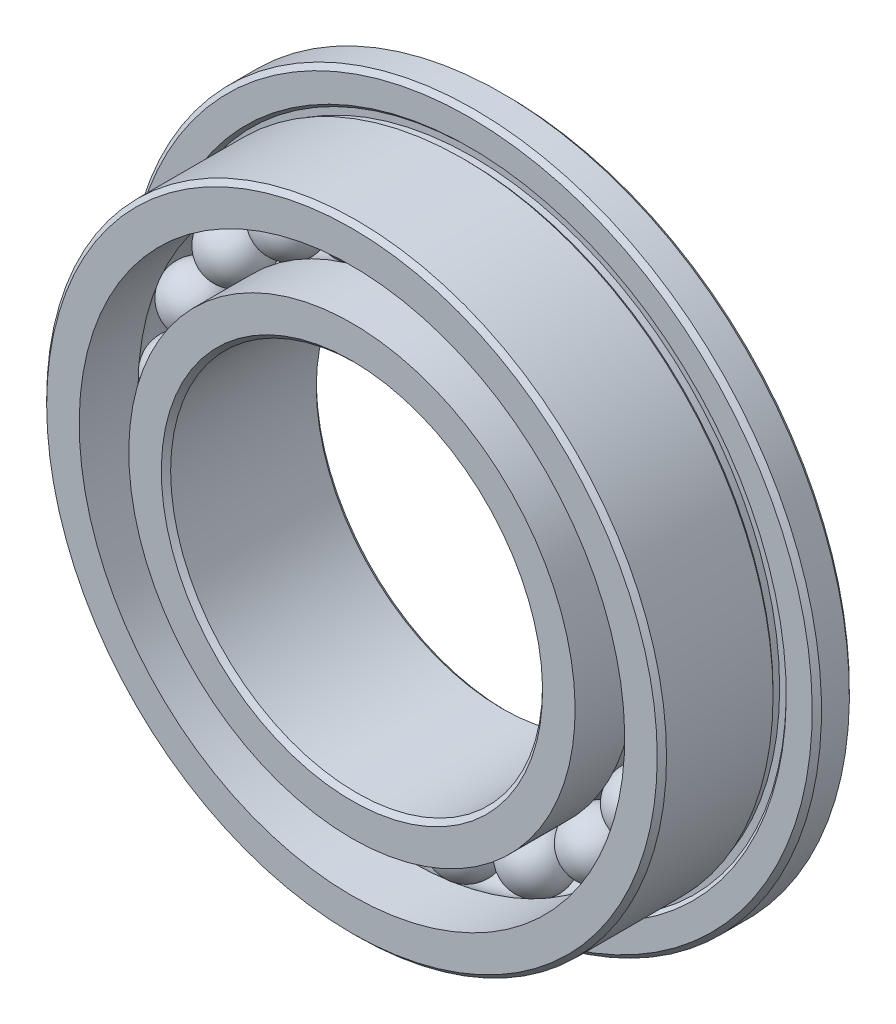
ISO-10303-21;
HEADER;
FILE_DESCRIPTION(('STEP AP214'),'2;1');
FILE_NAME('part.step','',(''),(''),'','','');
FILE_SCHEMA(('AUTOMOTIVE_DESIGN { 1 0 10303 214 1 1 1 1 }'));
ENDSEC;
DATA;
#1=APPLICATION_CONTEXT('core data for automotive mechanical design processes');
#2=APPLICATION_PROTOCOL_DEFINITION('international standard','automotive_design',2000,#1);
#3=PRODUCT_CONTEXT('',#1,'mechanical');
#4=PRODUCT('Part','Part','',(#3));
#5=PRODUCT_RELATED_PRODUCT_CATEGORY('part','',(#4));
#6=PRODUCT_DEFINITION_FORMATION('','',#4);
#7=PRODUCT_DEFINITION_CONTEXT('part definition',#1,'design');
#8=PRODUCT_DEFINITION('design','',#6,#7);
#9=PRODUCT_DEFINITION_SHAPE('','',#8);
#10=(LENGTH_UNIT() NAMED_UNIT(*) SI_UNIT(.MILLI.,.METRE.));
#11=(NAMED_UNIT(*) PLANE_ANGLE_UNIT() SI_UNIT($,.RADIAN.));
#12=(NAMED_UNIT(*) SI_UNIT($,.STERADIAN.) SOLID_ANGLE_UNIT());
#13=UNCERTAINTY_MEASURE_WITH_UNIT(LENGTH_MEASURE(1.E-05),#10,'distance_accuracy_value','');
#14=(GEOMETRIC_REPRESENTATION_CONTEXT(3) GLOBAL_UNCERTAINTY_ASSIGNED_CONTEXT((#13)) GLOBAL_UNIT_ASSIGNED_CONTEXT((#10,
#11,#12)) REPRESENTATION_CONTEXT('',''));
#15=CARTESIAN_POINT('',(0.,0.,0.));
#16=DIRECTION('',(0.,0.,1.));
#17=DIRECTION('',(1.,0.,0.));
#18=AXIS2_PLACEMENT_3D('',#15,#16,#17);
#19=CARTESIAN_POINT('',(-1.17902069764356,3.82229122314458,0.));
#20=DIRECTION('',(-0.294755174410891,0.955572805786145,0.));
#21=DIRECTION('',(0.955572805786145,0.294755174410891,0.));
#22=AXIS2_PLACEMENT_3D('',#19,#20,#21);
#23=SPHERICAL_SURFACE('',#22,0.5);
#24=CARTESIAN_POINT('',(-1.32639828484901,4.30007762603765,0.));
#25=VERTEX_POINT('',#24);
#26=VERTEX_LOOP('',#25);
#27=FACE_BOUND('',#26,.T.);
#28=ADVANCED_FACE('F50',(#27),#23,.T.);
#29=CLOSED_SHELL('',(#28));
#30=MANIFOLD_SOLID_BREP('B2',#29);
#31=CARTESIAN_POINT('',(-2.25328023225445,3.30495509726401,0.));
#32=DIRECTION('',(-0.563320058063612,0.826238774316002,0.));
#33=DIRECTION('',(0.826238774316002,0.563320058063612,0.));
#34=AXIS2_PLACEMENT_3D('',#31,#32,#33);
#35=SPHERICAL_SURFACE('',#34,0.5);
#36=CARTESIAN_POINT('',(-2.53494026128625,3.71807448442201,0.));
#37=VERTEX_POINT('',#36);
#38=VERTEX_LOOP('',#37);
#39=FACE_BOUND('',#38,.T.);
#40=ADVANCED_FACE('F71',(#39),#35,.T.);
#41=CLOSED_SHELL('',(#40));
#42=MANIFOLD_SOLID_BREP('B7',#41);
#43=CARTESIAN_POINT('',(-3.12732592987209,2.49395920743497,0.));
#44=DIRECTION('',(-0.781831482468022,0.623489801858743,0.));
#45=DIRECTION('',(0.623489801858743,0.781831482468022,0.));
#46=AXIS2_PLACEMENT_3D('',#43,#44,#45);
#47=SPHERICAL_SURFACE('',#46,0.5);
#48=CARTESIAN_POINT('',(-3.5182416711061,2.80570410836434,0.));
#49=VERTEX_POINT('',#48);
#50=VERTEX_LOOP('',#49);
#51=FACE_BOUND('',#50,.T.);
#52=ADVANCED_FACE('F92',(#51),#47,.T.);
#53=CLOSED_SHELL('',(#52));
#54=MANIFOLD_SOLID_BREP('B46',#53);
#55=CARTESIAN_POINT('',(-3.7234949945768,1.46136409746562,0.));
#56=DIRECTION('',(-0.9308737486442,0.365341024366405,0.));
#57=DIRECTION('',(0.365341024366405,0.9308737486442,0.));
#58=AXIS2_PLACEMENT_3D('',#55,#56,#57);
#59=SPHERICAL_SURFACE('',#58,0.5);
#60=CARTESIAN_POINT('',(-4.1889318688989,1.64403460964882,0.));
#61=VERTEX_POINT('',#60);
#62=VERTEX_LOOP('',#61);
#63=FACE_BOUND('',#62,.T.);
#64=ADVANCED_FACE('F113',(#63),#59,.T.);
#65=CLOSED_SHELL('',(#64));
#66=MANIFOLD_SOLID_BREP('B67',#65);
#67=CARTESIAN_POINT('',(-3.98881518872472,0.29892037434574,0.));
#68=DIRECTION('',(-0.997203797181179,0.0747300935864348,0.));
#69=DIRECTION('',(0.0747300935864348,0.997203797181179,0.));
#70=AXIS2_PLACEMENT_3D('',#67,#68,#69);
#71=SPHERICAL_SURFACE('',#70,0.5);
#72=CARTESIAN_POINT('',(-4.48741708731531,0.336285421138957,0.));
#73=VERTEX_POINT('',#72);
#74=VERTEX_LOOP('',#73);
#75=FACE_BOUND('',#74,.T.);
#76=ADVANCED_FACE('F134',(#75),#71,.T.);
#77=CLOSED_SHELL('',(#76));
#78=MANIFOLD_SOLID_BREP('B88',#77);
#79=CARTESIAN_POINT('',(-3.8997116487273,-0.890083735825217,0.));
#80=DIRECTION('',(-0.974927912181826,-0.222520933956304,0.));
#81=DIRECTION('',(-0.222520933956304,0.974927912181826,0.));
#82=AXIS2_PLACEMENT_3D('',#79,#80,#81);
#83=SPHERICAL_SURFACE('',#82,0.5);
#84=CARTESIAN_POINT('',(-4.38717560481822,-1.00134420280337,0.));
#85=VERTEX_POINT('',#84);
#86=VERTEX_LOOP('',#85);
#87=FACE_BOUND('',#86,.T.);
#88=ADVANCED_FACE('F155',(#87),#83,.T.);
#89=CLOSED_SHELL('',(#88));
#90=MANIFOLD_SOLID_BREP('B109',#89);
#91=CARTESIAN_POINT('',(-3.46410161513777,-1.99999999999997,0.));
#92=DIRECTION('',(-0.866025403784443,-0.499999999999992,0.));
#93=DIRECTION('',(-0.499999999999992,0.866025403784443,0.));
#94=AXIS2_PLACEMENT_3D('',#91,#92,#93);
#95=SPHERICAL_SURFACE('',#94,0.5);
#96=CARTESIAN_POINT('',(-3.89711431702999,-2.24999999999996,0.));
#97=VERTEX_POINT('',#96);
#98=VERTEX_LOOP('',#97);
#99=FACE_BOUND('',#98,.T.);
#100=ADVANCED_FACE('F176',(#99),#95,.T.);
#101=CLOSED_SHELL('',(#100));
#102=MANIFOLD_SOLID_BREP('B130',#101);
#103=CARTESIAN_POINT('',(-2.7206909510837,-2.93220748731928,0.));
#104=DIRECTION('',(-0.680172737770926,-0.733051871829821,0.));
#105=DIRECTION('',(-0.733051871829821,0.680172737770926,0.));
#106=AXIS2_PLACEMENT_3D('',#103,#104,#105);
#107=SPHERICAL_SURFACE('',#106,0.5);
#108=CARTESIAN_POINT('',(-3.06077731996917,-3.29873342323419,0.));
#109=VERTEX_POINT('',#108);
#110=VERTEX_LOOP('',#109);
#111=FACE_BOUND('',#110,.T.);
#112=ADVANCED_FACE('F197',(#111),#107,.T.);
#113=CLOSED_SHELL('',(#112));
#114=MANIFOLD_SOLID_BREP('B151',#113);
#115=CARTESIAN_POINT('',(-1.73553495647026,-3.60387547160966,0.));
#116=DIRECTION('',(-0.433883739117565,-0.900968867902416,0.));
#117=DIRECTION('',(-0.900968867902416,0.433883739117565,0.));
#118=AXIS2_PLACEMENT_3D('',#115,#116,#117);
#119=SPHERICAL_SURFACE('',#118,0.5);
#120=CARTESIAN_POINT('',(-1.95247682602904,-4.05435990556087,0.));
#121=VERTEX_POINT('',#120);
#122=VERTEX_LOOP('',#121);
#123=FACE_BOUND('',#122,.T.);
#124=ADVANCED_FACE('F218',(#123),#119,.T.);
#125=CLOSED_SHELL('',(#124));
#126=MANIFOLD_SOLID_BREP('B172',#125);
#127=CARTESIAN_POINT('',(-0.596169064704728,-3.95532330490051,0.));
#128=DIRECTION('',(-0.149042266176182,-0.988830826225127,0.));
#129=DIRECTION('',(-0.988830826225127,0.149042266176182,0.));
#130=AXIS2_PLACEMENT_3D('',#127,#128,#129);
#131=SPHERICAL_SURFACE('',#130,0.5);
#132=CARTESIAN_POINT('',(-0.670690197792819,-4.44973871801307,0.));
#133=VERTEX_POINT('',#132);
#134=VERTEX_LOOP('',#133);
#135=FACE_BOUND('',#134,.T.);
#136=ADVANCED_FACE('F239',(#135),#131,.T.);
#137=CLOSED_SHELL('',(#136));
#138=MANIFOLD_SOLID_BREP('B193',#137);
#139=CARTESIAN_POINT('',(0.596169064704671,-3.95532330490052,0.));
#140=DIRECTION('',(0.149042266176168,-0.98883082622513,0.));
#141=DIRECTION('',(-0.98883082622513,-0.149042266176168,0.));
#142=AXIS2_PLACEMENT_3D('',#139,#140,#141);
#143=SPHERICAL_SURFACE('',#142,0.5);
#144=CARTESIAN_POINT('',(0.670690197792755,-4.44973871801308,0.));
#145=VERTEX_POINT('',#144);
#146=VERTEX_LOOP('',#145);
#147=FACE_BOUND('',#146,.T.);
#148=ADVANCED_FACE('F260',(#147),#143,.T.);
#149=CLOSED_SHELL('',(#148));
#150=MANIFOLD_SOLID_BREP('B214',#149);
#151=CARTESIAN_POINT('',(1.73553495647021,-3.60387547160969,0.));
#152=DIRECTION('',(0.433883739117553,-0.900968867902422,0.));
#153=DIRECTION('',(-0.900968867902422,-0.433883739117553,0.));
#154=AXIS2_PLACEMENT_3D('',#151,#152,#153);
#155=SPHERICAL_SURFACE('',#154,0.5);
#156=CARTESIAN_POINT('',(1.95247682602899,-4.0543599055609,0.));
#157=VERTEX_POINT('',#156);
#158=VERTEX_LOOP('',#157);
#159=FACE_BOUND('',#158,.T.);
#160=ADVANCED_FACE('F281',(#159),#155,.T.);
#161=CLOSED_SHELL('',(#160));
#162=MANIFOLD_SOLID_BREP('B235',#161);
#163=CARTESIAN_POINT('',(2.72069095108366,-2.93220748731932,0.));
#164=DIRECTION('',(0.680172737770916,-0.73305187182983,0.));
#165=DIRECTION('',(-0.73305187182983,-0.680172737770916,0.));
#166=AXIS2_PLACEMENT_3D('',#163,#164,#165);
#167=SPHERICAL_SURFACE('',#166,0.5);
#168=CARTESIAN_POINT('',(3.06077731996912,-3.29873342323423,0.));
#169=VERTEX_POINT('',#168);
#170=VERTEX_LOOP('',#169);
#171=FACE_BOUND('',#170,.T.);
#172=ADVANCED_FACE('F302',(#171),#167,.T.);
#173=CLOSED_SHELL('',(#172));
#174=MANIFOLD_SOLID_BREP('B256',#173);
#175=CARTESIAN_POINT('',(3.46410161513775,-2.00000000000002,0.));
#176=DIRECTION('',(0.866025403784437,-0.500000000000004,0.));
#177=DIRECTION('',(-0.500000000000004,-0.866025403784437,0.));
#178=AXIS2_PLACEMENT_3D('',#175,#176,#177);
#179=SPHERICAL_SURFACE('',#178,0.5);
#180=CARTESIAN_POINT('',(3.89711431702996,-2.25000000000002,0.));
#181=VERTEX_POINT('',#180);
#182=VERTEX_LOOP('',#181);
#183=FACE_BOUND('',#182,.T.);
#184=ADVANCED_FACE('F323',(#183),#179,.T.);
#185=CLOSED_SHELL('',(#184));
#186=MANIFOLD_SOLID_BREP('B277',#185);
#187=CARTESIAN_POINT('',(3.89971164872729,-0.890083735825273,0.));
#188=DIRECTION('',(0.974927912181823,-0.222520933956318,0.));
#189=DIRECTION('',(-0.222520933956318,-0.974927912181823,0.));
#190=AXIS2_PLACEMENT_3D('',#187,#188,#189);
#191=SPHERICAL_SURFACE('',#190,0.5);
#192=CARTESIAN_POINT('',(4.3871756048182,-1.00134420280343,0.));
#193=VERTEX_POINT('',#192);
#194=VERTEX_LOOP('',#193);
#195=FACE_BOUND('',#194,.T.);
#196=ADVANCED_FACE('F344',(#195),#191,.T.);
#197=CLOSED_SHELL('',(#196));
#198=MANIFOLD_SOLID_BREP('B298',#197);
#199=CARTESIAN_POINT('',(3.98881518872472,0.298920374345683,0.));
#200=DIRECTION('',(0.997203797181181,0.074730093586421,0.));
#201=DIRECTION('',(0.074730093586421,-0.997203797181181,0.));
#202=AXIS2_PLACEMENT_3D('',#199,#200,#201);
#203=SPHERICAL_SURFACE('',#202,0.5);
#204=CARTESIAN_POINT('',(4.48741708731531,0.336285421138894,0.));
#205=VERTEX_POINT('',#204);
#206=VERTEX_LOOP('',#205);
#207=FACE_BOUND('',#206,.T.);
#208=ADVANCED_FACE('F365',(#207),#203,.T.);
#209=CLOSED_SHELL('',(#208));
#210=MANIFOLD_SOLID_BREP('B319',#209);
#211=CARTESIAN_POINT('',(3.72349499457682,1.46136409746557,0.));
#212=DIRECTION('',(0.930873748644205,0.365341024366393,0.));
#213=DIRECTION('',(0.365341024366393,-0.930873748644205,0.));
#214=AXIS2_PLACEMENT_3D('',#211,#212,#213);
#215=SPHERICAL_SURFACE('',#214,0.5);
#216=CARTESIAN_POINT('',(4.18893186889892,1.64403460964877,0.));
#217=VERTEX_POINT('',#216);
#218=VERTEX_LOOP('',#217);
#219=FACE_BOUND('',#218,.T.);
#220=ADVANCED_FACE('F386',(#219),#215,.T.);
#221=CLOSED_SHELL('',(#220));
#222=MANIFOLD_SOLID_BREP('B340',#221);
#223=CARTESIAN_POINT('',(3.12732592987212,2.49395920743493,0.));
#224=DIRECTION('',(0.781831482468031,0.623489801858732,0.));
#225=DIRECTION('',(0.623489801858732,-0.781831482468031,0.));
#226=AXIS2_PLACEMENT_3D('',#223,#224,#225);
#227=SPHERICAL_SURFACE('',#226,0.5);
#228=CARTESIAN_POINT('',(3.51824167110614,2.80570410836429,0.));
#229=VERTEX_POINT('',#228);
#230=VERTEX_LOOP('',#229);
#231=FACE_BOUND('',#230,.T.);
#232=ADVANCED_FACE('F407',(#231),#227,.T.);
#233=CLOSED_SHELL('',(#232));
#234=MANIFOLD_SOLID_BREP('B361',#233);
#235=CARTESIAN_POINT('',(2.25328023225449,3.30495509726398,0.));
#236=DIRECTION('',(0.563320058063623,0.826238774315994,0.));
#237=DIRECTION('',(0.826238774315994,-0.563320058063623,0.));
#238=AXIS2_PLACEMENT_3D('',#235,#236,#237);
#239=SPHERICAL_SURFACE('',#238,0.5);
#240=CARTESIAN_POINT('',(2.5349402612863,3.71807448442197,0.));
#241=VERTEX_POINT('',#240);
#242=VERTEX_LOOP('',#241);
#243=FACE_BOUND('',#242,.T.);
#244=ADVANCED_FACE('F428',(#243),#239,.T.);
#245=CLOSED_SHELL('',(#244));
#246=MANIFOLD_SOLID_BREP('B382',#245);
#247=CARTESIAN_POINT('',(1.17902069764362,3.82229122314456,0.));
#248=DIRECTION('',(0.294755174410905,0.955572805786141,0.));
#249=DIRECTION('',(0.955572805786141,-0.294755174410905,0.));
#250=AXIS2_PLACEMENT_3D('',#247,#248,#249);
#251=SPHERICAL_SURFACE('',#250,0.5);
#252=CARTESIAN_POINT('',(1.32639828484907,4.30007762603763,0.));
#253=VERTEX_POINT('',#252);
#254=VERTEX_LOOP('',#253);
#255=FACE_BOUND('',#254,.T.);
#256=ADVANCED_FACE('F449',(#255),#251,.T.);
#257=CLOSED_SHELL('',(#256));
#258=MANIFOLD_SOLID_BREP('B403',#257);
#259=CARTESIAN_POINT('',(0.,4.,0.));
#260=DIRECTION('',(0.,1.,0.));
#261=DIRECTION('',(1.,0.,0.));
#262=AXIS2_PLACEMENT_3D('',#259,#260,#261);
#263=SPHERICAL_SURFACE('',#262,0.5);
#264=CARTESIAN_POINT('',(0.,4.5,0.));
#265=VERTEX_POINT('',#264);
#266=VERTEX_LOOP('',#265);
#267=FACE_BOUND('',#266,.T.);
#268=ADVANCED_FACE('F473',(#267),#263,.T.);
#269=CLOSED_SHELL('',(#268));
#270=MANIFOLD_SOLID_BREP('B424',#269);
#271=CARTESIAN_POINT('',(0.,0.,0.));
#272=DIRECTION('',(0.,0.,1.));
#273=DIRECTION('',(0.,-1.,0.));
#274=AXIS2_PLACEMENT_3D('',#271,#272,#273);
#275=CYLINDRICAL_SURFACE('',#274,3.6);
#276=CARTESIAN_POINT('',(0.,0.,-0.3));
#277=DIRECTION('',(0.,0.,1.));
#278=DIRECTION('',(0.,-1.,0.));
#279=AXIS2_PLACEMENT_3D('',#276,#277,#278);
#280=CIRCLE('',#279,3.6);
#281=CARTESIAN_POINT('',(0.,-3.6,-0.3));
#282=VERTEX_POINT('',#281);
#283=EDGE_CURVE('E521',#282,#282,#280,.T.);
#284=ORIENTED_EDGE('',*,*,#283,.F.);
#285=EDGE_LOOP('',(#284));
#286=FACE_BOUND('',#285,.T.);
#287=CARTESIAN_POINT('',(0.,0.,-1.25));
#288=DIRECTION('',(0.,0.,1.));
#289=DIRECTION('',(0.,-1.,0.));
#290=AXIS2_PLACEMENT_3D('',#287,#288,#289);
#291=CIRCLE('',#290,3.6);
#292=CARTESIAN_POINT('',(0.,-3.6,-1.25));
#293=VERTEX_POINT('',#292);
#294=EDGE_CURVE('E533',#293,#293,#291,.T.);
#295=ORIENTED_EDGE('',*,*,#294,.T.);
#296=EDGE_LOOP('',(#295));
#297=FACE_BOUND('',#296,.T.);
#298=ADVANCED_FACE('F495',(#286,#297),#275,.T.);
#299=CARTESIAN_POINT('',(0.,0.,0.));
#300=DIRECTION('',(0.,0.,1.));
#301=DIRECTION('',(0.,-1.,0.));
#302=AXIS2_PLACEMENT_3D('',#299,#300,#301);
#303=TOROIDAL_SURFACE('',#302,4.,0.5);
#304=CARTESIAN_POINT('',(0.,0.,0.3));
#305=DIRECTION('',(0.,0.,1.));
#306=DIRECTION('',(0.,-1.,0.));
#307=AXIS2_PLACEMENT_3D('',#304,#305,#306);
#308=CIRCLE('',#307,3.6);
#309=CARTESIAN_POINT('',(0.,-3.6,0.3));
#310=VERTEX_POINT('',#309);
#311=EDGE_CURVE('E525',#310,#310,#308,.T.);
#312=ORIENTED_EDGE('',*,*,#311,.F.);
#313=EDGE_LOOP('',(#312));
#314=FACE_BOUND('',#313,.T.);
#315=ORIENTED_EDGE('',*,*,#283,.T.);
#316=EDGE_LOOP('',(#315));
#317=FACE_BOUND('',#316,.T.);
#318=ADVANCED_FACE('F554',(#314,#317),#303,.F.);
#319=CARTESIAN_POINT('',(0.,0.,0.));
#320=DIRECTION('',(0.,0.,1.));
#321=DIRECTION('',(0.,-1.,0.));
#322=AXIS2_PLACEMENT_3D('',#319,#320,#321);
#323=CYLINDRICAL_SURFACE('',#322,3.6);
#324=CARTESIAN_POINT('',(0.,0.,1.25));
#325=DIRECTION('',(0.,0.,1.));
#326=DIRECTION('',(0.,-1.,0.));
#327=AXIS2_PLACEMENT_3D('',#324,#325,#326);
#328=CIRCLE('',#327,3.6);
#329=CARTESIAN_POINT('',(0.,-3.6,1.25));
#330=VERTEX_POINT('',#329);
#331=EDGE_CURVE('E529',#330,#330,#328,.T.);
#332=ORIENTED_EDGE('',*,*,#331,.F.);
#333=EDGE_LOOP('',(#332));
#334=FACE_BOUND('',#333,.T.);
#335=ORIENTED_EDGE('',*,*,#311,.T.);
#336=EDGE_LOOP('',(#335));
#337=FACE_BOUND('',#336,.T.);
#338=ADVANCED_FACE('F560',(#334,#337),#323,.T.);
#339=CARTESIAN_POINT('',(0.,3.,1.25));
#340=DIRECTION('',(0.,0.,-1.));
#341=DIRECTION('',(0.,1.,0.));
#342=AXIS2_PLACEMENT_3D('',#339,#340,#341);
#343=PLANE('',#342);
#344=CARTESIAN_POINT('',(0.,0.,1.25));
#345=DIRECTION('',(0.,0.,-1.));
#346=DIRECTION('',(0.,1.,0.));
#347=AXIS2_PLACEMENT_3D('',#344,#345,#346);
#348=CIRCLE('',#347,3.075);
#349=CARTESIAN_POINT('',(0.,3.075,1.25));
#350=VERTEX_POINT('',#349);
#351=EDGE_CURVE('E472',#350,#350,#348,.T.);
#352=ORIENTED_EDGE('',*,*,#351,.T.);
#353=EDGE_LOOP('',(#352));
#354=FACE_BOUND('',#353,.T.);
#355=ORIENTED_EDGE('',*,*,#331,.T.);
#356=EDGE_LOOP('',(#355));
#357=FACE_BOUND('',#356,.T.);
#358=ADVANCED_FACE('F551',(#354,#357),#343,.F.);
#359=CARTESIAN_POINT('',(0.,0.,0.));
#360=DIRECTION('',(0.,0.,1.));
#361=DIRECTION('',(0.,-1.,0.));
#362=AXIS2_PLACEMENT_3D('',#359,#360,#361);
#363=CYLINDRICAL_SURFACE('',#362,3.);
#364=CARTESIAN_POINT('',(0.,0.,-1.175));
#365=DIRECTION('',(0.,0.,1.));
#366=DIRECTION('',(0.,-1.,0.));
#367=AXIS2_PLACEMENT_3D('',#364,#365,#366);
#368=CIRCLE('',#367,3.);
#369=CARTESIAN_POINT('',(0.,-3.,-1.175));
#370=VERTEX_POINT('',#369);
#371=EDGE_CURVE('E503',#370,#370,#368,.F.);
#372=ORIENTED_EDGE('',*,*,#371,.T.);
#373=EDGE_LOOP('',(#372));
#374=FACE_BOUND('',#373,.T.);
#375=CARTESIAN_POINT('',(0.,0.,1.175));
#376=DIRECTION('',(0.,0.,-1.));
#377=DIRECTION('',(0.,1.,0.));
#378=AXIS2_PLACEMENT_3D('',#375,#376,#377);
#379=CIRCLE('',#378,3.);
#380=CARTESIAN_POINT('',(0.,3.,1.175));
#381=VERTEX_POINT('',#380);
#382=EDGE_CURVE('E509',#381,#381,#379,.F.);
#383=ORIENTED_EDGE('',*,*,#382,.T.);
#384=EDGE_LOOP('',(#383));
#385=FACE_BOUND('',#384,.T.);
#386=ADVANCED_FACE('F543',(#374,#385),#363,.F.);
#387=CARTESIAN_POINT('',(0.,3.6,-1.25));
#388=DIRECTION('',(0.,0.,1.));
#389=DIRECTION('',(0.,-1.,0.));
#390=AXIS2_PLACEMENT_3D('',#387,#388,#389);
#391=PLANE('',#390);
#392=CARTESIAN_POINT('',(0.,0.,-1.25));
#393=DIRECTION('',(0.,0.,1.));
#394=DIRECTION('',(0.,-1.,0.));
#395=AXIS2_PLACEMENT_3D('',#392,#393,#394);
#396=CIRCLE('',#395,3.075);
#397=CARTESIAN_POINT('',(0.,-3.075,-1.25));
#398=VERTEX_POINT('',#397);
#399=EDGE_CURVE('E515',#398,#398,#396,.T.);
#400=ORIENTED_EDGE('',*,*,#399,.T.);
#401=EDGE_LOOP('',(#400));
#402=FACE_BOUND('',#401,.T.);
#403=ORIENTED_EDGE('',*,*,#294,.F.);
#404=EDGE_LOOP('',(#403));
#405=FACE_BOUND('',#404,.T.);
#406=ADVANCED_FACE('F540',(#402,#405),#391,.F.);
#407=CARTESIAN_POINT('',(0.,0.,-1.25));
#408=DIRECTION('',(0.,0.,-1.));
#409=DIRECTION('',(0.,1.,0.));
#410=AXIS2_PLACEMENT_3D('',#407,#408,#409);
#411=CONICAL_SURFACE('',#410,3.075,0.785398163397448);
#412=ORIENTED_EDGE('',*,*,#371,.F.);
#413=EDGE_LOOP('',(#412));
#414=FACE_BOUND('',#413,.T.);
#415=ORIENTED_EDGE('',*,*,#399,.F.);
#416=EDGE_LOOP('',(#415));
#417=FACE_BOUND('',#416,.T.);
#418=ADVANCED_FACE('F542',(#414,#417),#411,.F.);
#419=CARTESIAN_POINT('',(0.,0.,1.175));
#420=DIRECTION('',(0.,0.,1.));
#421=DIRECTION('',(0.,-1.,0.));
#422=AXIS2_PLACEMENT_3D('',#419,#420,#421);
#423=CONICAL_SURFACE('',#422,3.,0.785398163397448);
#424=ORIENTED_EDGE('',*,*,#351,.F.);
#425=EDGE_LOOP('',(#424));
#426=FACE_BOUND('',#425,.T.);
#427=ORIENTED_EDGE('',*,*,#382,.F.);
#428=EDGE_LOOP('',(#427));
#429=FACE_BOUND('',#428,.T.);
#430=ADVANCED_FACE('F497',(#426,#429),#423,.F.);
#431=CLOSED_SHELL('',(#298,#318,#338,#358,#386,#406,#418,#430));
#432=MANIFOLD_SOLID_BREP('B445',#431);
#433=CARTESIAN_POINT('',(0.,4.4,-1.25));
#434=DIRECTION('',(0.,0.,1.));
#435=DIRECTION('',(0.,-1.,0.));
#436=AXIS2_PLACEMENT_3D('',#433,#434,#435);
#437=PLANE('',#436);
#438=CARTESIAN_POINT('',(0.,0.,-1.25));
#439=DIRECTION('',(0.,0.,1.));
#440=DIRECTION('',(0.,-1.,0.));
#441=AXIS2_PLACEMENT_3D('',#438,#439,#440);
#442=CIRCLE('',#441,5.525);
#443=CARTESIAN_POINT('',(0.,-5.525,-1.25));
#444=VERTEX_POINT('',#443);
#445=EDGE_CURVE('E654',#444,#444,#442,.F.);
#446=ORIENTED_EDGE('',*,*,#445,.T.);
#447=EDGE_LOOP('',(#446));
#448=FACE_BOUND('',#447,.T.);
#449=CARTESIAN_POINT('',(0.,0.,-1.25));
#450=DIRECTION('',(0.,0.,1.));
#451=DIRECTION('',(0.,-1.,0.));
#452=AXIS2_PLACEMENT_3D('',#449,#450,#451);
#453=CIRCLE('',#452,4.4);
#454=CARTESIAN_POINT('',(0.,-4.4,-1.25));
#455=VERTEX_POINT('',#454);
#456=EDGE_CURVE('E668',#455,#455,#453,.T.);
#457=ORIENTED_EDGE('',*,*,#456,.T.);
#458=EDGE_LOOP('',(#457));
#459=FACE_BOUND('',#458,.T.);
#460=ADVANCED_FACE('F634',(#448,#459),#437,.F.);
#461=CARTESIAN_POINT('',(0.,0.,0.));
#462=DIRECTION('',(0.,0.,1.));
#463=DIRECTION('',(0.,-1.,0.));
#464=AXIS2_PLACEMENT_3D('',#461,#462,#463);
#465=CYLINDRICAL_SURFACE('',#464,4.4);
#466=ORIENTED_EDGE('',*,*,#456,.F.);
#467=EDGE_LOOP('',(#466));
#468=FACE_BOUND('',#467,.T.);
#469=CARTESIAN_POINT('',(0.,0.,-0.3));
#470=DIRECTION('',(0.,0.,1.));
#471=DIRECTION('',(0.,-1.,0.));
#472=AXIS2_PLACEMENT_3D('',#469,#470,#471);
#473=CIRCLE('',#472,4.4);
#474=CARTESIAN_POINT('',(0.,-4.4,-0.3));
#475=VERTEX_POINT('',#474);
#476=EDGE_CURVE('E672',#475,#475,#473,.T.);
#477=ORIENTED_EDGE('',*,*,#476,.T.);
#478=EDGE_LOOP('',(#477));
#479=FACE_BOUND('',#478,.T.);
#480=ADVANCED_FACE('F724',(#468,#479),#465,.F.);
#481=CARTESIAN_POINT('',(0.,0.,0.));
#482=DIRECTION('',(0.,0.,1.));
#483=DIRECTION('',(0.,-1.,0.));
#484=AXIS2_PLACEMENT_3D('',#481,#482,#483);
#485=TOROIDAL_SURFACE('',#484,4.,0.5);
#486=ORIENTED_EDGE('',*,*,#476,.F.);
#487=EDGE_LOOP('',(#486));
#488=FACE_BOUND('',#487,.T.);
#489=CARTESIAN_POINT('',(0.,0.,0.3));
#490=DIRECTION('',(0.,0.,1.));
#491=DIRECTION('',(0.,-1.,0.));
#492=AXIS2_PLACEMENT_3D('',#489,#490,#491);
#493=CIRCLE('',#492,4.4);
#494=CARTESIAN_POINT('',(0.,-4.4,0.3));
#495=VERTEX_POINT('',#494);
#496=EDGE_CURVE('E676',#495,#495,#493,.T.);
#497=ORIENTED_EDGE('',*,*,#496,.T.);
#498=EDGE_LOOP('',(#497));
#499=FACE_BOUND('',#498,.T.);
#500=ADVANCED_FACE('F730',(#488,#499),#485,.F.);
#501=CARTESIAN_POINT('',(0.,0.,0.));
#502=DIRECTION('',(0.,0.,1.));
#503=DIRECTION('',(0.,-1.,0.));
#504=AXIS2_PLACEMENT_3D('',#501,#502,#503);
#505=CYLINDRICAL_SURFACE('',#504,4.4);
#506=ORIENTED_EDGE('',*,*,#496,.F.);
#507=EDGE_LOOP('',(#506));
#508=FACE_BOUND('',#507,.T.);
#509=CARTESIAN_POINT('',(0.,0.,1.25));
#510=DIRECTION('',(0.,0.,1.));
#511=DIRECTION('',(0.,-1.,0.));
#512=AXIS2_PLACEMENT_3D('',#509,#510,#511);
#513=CIRCLE('',#512,4.4);
#514=CARTESIAN_POINT('',(0.,-4.4,1.25));
#515=VERTEX_POINT('',#514);
#516=EDGE_CURVE('E680',#515,#515,#513,.T.);
#517=ORIENTED_EDGE('',*,*,#516,.T.);
#518=EDGE_LOOP('',(#517));
#519=FACE_BOUND('',#518,.T.);
#520=ADVANCED_FACE('F794',(#508,#519),#505,.F.);
#521=CARTESIAN_POINT('',(0.,5.,1.25));
#522=DIRECTION('',(0.,0.,-1.));
#523=DIRECTION('',(0.,1.,0.));
#524=AXIS2_PLACEMENT_3D('',#521,#522,#523);
#525=PLANE('',#524);
#526=CARTESIAN_POINT('',(0.,0.,1.25));
#527=DIRECTION('',(0.,0.,-1.));
#528=DIRECTION('',(0.,1.,0.));
#529=AXIS2_PLACEMENT_3D('',#526,#527,#528);
#530=CIRCLE('',#529,4.925);
#531=CARTESIAN_POINT('',(0.,4.925,1.25));
#532=VERTEX_POINT('',#531);
#533=EDGE_CURVE('E642',#532,#532,#530,.F.);
#534=ORIENTED_EDGE('',*,*,#533,.T.);
#535=EDGE_LOOP('',(#534));
#536=FACE_BOUND('',#535,.T.);
#537=ORIENTED_EDGE('',*,*,#516,.F.);
#538=EDGE_LOOP('',(#537));
#539=FACE_BOUND('',#538,.T.);
#540=ADVANCED_FACE('F784',(#536,#539),#525,.F.);
#541=CARTESIAN_POINT('',(0.,0.,0.));
#542=DIRECTION('',(0.,0.,1.));
#543=DIRECTION('',(0.,-1.,0.));
#544=AXIS2_PLACEMENT_3D('',#541,#542,#543);
#545=CYLINDRICAL_SURFACE('',#544,5.);
#546=CARTESIAN_POINT('',(0.,0.,1.175));
#547=DIRECTION('',(0.,0.,-1.));
#548=DIRECTION('',(0.,1.,0.));
#549=AXIS2_PLACEMENT_3D('',#546,#547,#548);
#550=CIRCLE('',#549,5.);
#551=CARTESIAN_POINT('',(0.,5.,1.175));
#552=VERTEX_POINT('',#551);
#553=EDGE_CURVE('E494',#552,#552,#550,.T.);
#554=ORIENTED_EDGE('',*,*,#553,.T.);
#555=EDGE_LOOP('',(#554));
#556=FACE_BOUND('',#555,.T.);
#557=CARTESIAN_POINT('',(0.,0.,-0.543933982822015));
#558=DIRECTION('',(0.,0.,1.));
#559=DIRECTION('',(0.,-1.,0.));
#560=AXIS2_PLACEMENT_3D('',#557,#558,#559);
#561=CIRCLE('',#560,5.);
#562=CARTESIAN_POINT('',(0.,-5.,-0.543933982822015));
#563=VERTEX_POINT('',#562);
#564=EDGE_CURVE('E684',#563,#563,#561,.T.);
#565=ORIENTED_EDGE('',*,*,#564,.T.);
#566=EDGE_LOOP('',(#565));
#567=FACE_BOUND('',#566,.T.);
#568=ADVANCED_FACE('F778',(#556,#567),#545,.T.);
#569=CARTESIAN_POINT('',(0.,0.,-0.59696699141101));
#570=DIRECTION('',(0.,0.,1.));
#571=DIRECTION('',(0.,-1.,0.));
#572=AXIS2_PLACEMENT_3D('',#569,#570,#571);
#573=CONICAL_SURFACE('',#572,4.94696699141101,0.785398163397435);
#574=ORIENTED_EDGE('',*,*,#564,.F.);
#575=EDGE_LOOP('',(#574));
#576=FACE_BOUND('',#575,.T.);
#577=CARTESIAN_POINT('',(0.,0.,-0.59696699141101));
#578=DIRECTION('',(0.,0.,1.));
#579=DIRECTION('',(0.,-1.,0.));
#580=AXIS2_PLACEMENT_3D('',#577,#578,#579);
#581=CIRCLE('',#580,4.94696699141101);
#582=CARTESIAN_POINT('',(0.,-4.94696699141101,-0.59696699141101));
#583=VERTEX_POINT('',#582);
#584=EDGE_CURVE('E688',#583,#583,#581,.T.);
#585=ORIENTED_EDGE('',*,*,#584,.T.);
#586=EDGE_LOOP('',(#585));
#587=FACE_BOUND('',#586,.T.);
#588=ADVANCED_FACE('F783',(#576,#587),#573,.T.);
#589=CARTESIAN_POINT('',(0.,0.,0.));
#590=DIRECTION('',(0.,0.,1.));
#591=DIRECTION('',(0.,-1.,0.));
#592=AXIS2_PLACEMENT_3D('',#589,#590,#591);
#593=CYLINDRICAL_SURFACE('',#592,4.94696699141101);
#594=ORIENTED_EDGE('',*,*,#584,.F.);
#595=EDGE_LOOP('',(#594));
#596=FACE_BOUND('',#595,.T.);
#597=CARTESIAN_POINT('',(0.,0.,-0.703033008588993));
#598=DIRECTION('',(0.,0.,1.));
#599=DIRECTION('',(0.,-1.,0.));
#600=AXIS2_PLACEMENT_3D('',#597,#598,#599);
#601=CIRCLE('',#600,4.94696699141101);
#602=CARTESIAN_POINT('',(0.,-4.94696699141101,-0.703033008588993));
#603=VERTEX_POINT('',#602);
#604=EDGE_CURVE('E692',#603,#603,#601,.T.);
#605=ORIENTED_EDGE('',*,*,#604,.T.);
#606=EDGE_LOOP('',(#605));
#607=FACE_BOUND('',#606,.T.);
#608=ADVANCED_FACE('F816',(#596,#607),#593,.T.);
#609=CARTESIAN_POINT('',(0.,5.05303300858899,-0.703033008588992));
#610=DIRECTION('',(0.,0.,-1.));
#611=DIRECTION('',(0.,1.,0.));
#612=AXIS2_PLACEMENT_3D('',#609,#610,#611);
#613=PLANE('',#612);
#614=ORIENTED_EDGE('',*,*,#604,.F.);
#615=EDGE_LOOP('',(#614));
#616=FACE_BOUND('',#615,.T.);
#617=CARTESIAN_POINT('',(0.,0.,-0.703033008588992));
#618=DIRECTION('',(0.,0.,1.));
#619=DIRECTION('',(0.,-1.,0.));
#620=AXIS2_PLACEMENT_3D('',#617,#618,#619);
#621=CIRCLE('',#620,5.05303300858899);
#622=CARTESIAN_POINT('',(0.,-5.05303300858899,-0.703033008588992));
#623=VERTEX_POINT('',#622);
#624=EDGE_CURVE('E696',#623,#623,#621,.T.);
#625=ORIENTED_EDGE('',*,*,#624,.T.);
#626=EDGE_LOOP('',(#625));
#627=FACE_BOUND('',#626,.T.);
#628=ADVANCED_FACE('F720',(#616,#627),#613,.F.);
#629=CARTESIAN_POINT('',(0.,0.,-0.650000000000001));
#630=DIRECTION('',(0.,0.,1.));
#631=DIRECTION('',(0.,-1.,0.));
#632=AXIS2_PLACEMENT_3D('',#629,#630,#631);
#633=CONICAL_SURFACE('',#632,5.10606601717798,0.785398163397436);
#634=ORIENTED_EDGE('',*,*,#624,.F.);
#635=EDGE_LOOP('',(#634));
#636=FACE_BOUND('',#635,.T.);
#637=CARTESIAN_POINT('',(0.,0.,-0.650000000000001));
#638=DIRECTION('',(0.,0.,1.));
#639=DIRECTION('',(0.,-1.,0.));
#640=AXIS2_PLACEMENT_3D('',#637,#638,#639);
#641=CIRCLE('',#640,5.10606601717798);
#642=CARTESIAN_POINT('',(0.,-5.10606601717798,-0.650000000000001));
#643=VERTEX_POINT('',#642);
#644=EDGE_CURVE('E700',#643,#643,#641,.T.);
#645=ORIENTED_EDGE('',*,*,#644,.T.);
#646=EDGE_LOOP('',(#645));
#647=FACE_BOUND('',#646,.T.);
#648=ADVANCED_FACE('F706',(#636,#647),#633,.F.);
#649=CARTESIAN_POINT('',(0.,5.6,-0.650000000000001));
#650=DIRECTION('',(0.,0.,-1.));
#651=DIRECTION('',(0.,1.,0.));
#652=AXIS2_PLACEMENT_3D('',#649,#650,#651);
#653=PLANE('',#652);
#654=CARTESIAN_POINT('',(0.,0.,-0.650000000000001));
#655=DIRECTION('',(0.,0.,-1.));
#656=DIRECTION('',(0.,1.,0.));
#657=AXIS2_PLACEMENT_3D('',#654,#655,#656);
#658=CIRCLE('',#657,5.525);
#659=CARTESIAN_POINT('',(0.,5.525,-0.650000000000001));
#660=VERTEX_POINT('',#659);
#661=EDGE_CURVE('E648',#660,#660,#658,.F.);
#662=ORIENTED_EDGE('',*,*,#661,.T.);
#663=EDGE_LOOP('',(#662));
#664=FACE_BOUND('',#663,.T.);
#665=ORIENTED_EDGE('',*,*,#644,.F.);
#666=EDGE_LOOP('',(#665));
#667=FACE_BOUND('',#666,.T.);
#668=ADVANCED_FACE('F708',(#664,#667),#653,.F.);
#669=CARTESIAN_POINT('',(0.,0.,0.));
#670=DIRECTION('',(0.,0.,1.));
#671=DIRECTION('',(0.,-1.,0.));
#672=AXIS2_PLACEMENT_3D('',#669,#670,#671);
#673=CYLINDRICAL_SURFACE('',#672,5.6);
#674=CARTESIAN_POINT('',(0.,0.,-1.175));
#675=DIRECTION('',(0.,0.,1.));
#676=DIRECTION('',(0.,-1.,0.));
#677=AXIS2_PLACEMENT_3D('',#674,#675,#676);
#678=CIRCLE('',#677,5.6);
#679=CARTESIAN_POINT('',(0.,-5.6,-1.175));
#680=VERTEX_POINT('',#679);
#681=EDGE_CURVE('E660',#680,#680,#678,.T.);
#682=ORIENTED_EDGE('',*,*,#681,.T.);
#683=EDGE_LOOP('',(#682));
#684=FACE_BOUND('',#683,.T.);
#685=CARTESIAN_POINT('',(0.,0.,-0.725000000000001));
#686=DIRECTION('',(0.,0.,-1.));
#687=DIRECTION('',(0.,1.,0.));
#688=AXIS2_PLACEMENT_3D('',#685,#686,#687);
#689=CIRCLE('',#688,5.6);
#690=CARTESIAN_POINT('',(0.,5.6,-0.725000000000001));
#691=VERTEX_POINT('',#690);
#692=EDGE_CURVE('E664',#691,#691,#689,.T.);
#693=ORIENTED_EDGE('',*,*,#692,.T.);
#694=EDGE_LOOP('',(#693));
#695=FACE_BOUND('',#694,.T.);
#696=ADVANCED_FACE('F710',(#684,#695),#673,.T.);
#697=CARTESIAN_POINT('',(0.,0.,-1.175));
#698=DIRECTION('',(0.,0.,1.));
#699=DIRECTION('',(0.,-1.,0.));
#700=AXIS2_PLACEMENT_3D('',#697,#698,#699);
#701=CONICAL_SURFACE('',#700,5.6,0.785398163397451);
#702=ORIENTED_EDGE('',*,*,#445,.F.);
#703=EDGE_LOOP('',(#702));
#704=FACE_BOUND('',#703,.T.);
#705=ORIENTED_EDGE('',*,*,#681,.F.);
#706=EDGE_LOOP('',(#705));
#707=FACE_BOUND('',#706,.T.);
#708=ADVANCED_FACE('F717',(#704,#707),#701,.T.);
#709=CARTESIAN_POINT('',(0.,0.,-0.650000000000001));
#710=DIRECTION('',(0.,0.,-1.));
#711=DIRECTION('',(0.,1.,0.));
#712=AXIS2_PLACEMENT_3D('',#709,#710,#711);
#713=CONICAL_SURFACE('',#712,5.525,0.785398163397451);
#714=ORIENTED_EDGE('',*,*,#692,.F.);
#715=EDGE_LOOP('',(#714));
#716=FACE_BOUND('',#715,.T.);
#717=ORIENTED_EDGE('',*,*,#661,.F.);
#718=EDGE_LOOP('',(#717));
#719=FACE_BOUND('',#718,.T.);
#720=ADVANCED_FACE('F737',(#716,#719),#713,.T.);
#721=CARTESIAN_POINT('',(0.,0.,1.25));
#722=DIRECTION('',(0.,0.,-1.));
#723=DIRECTION('',(0.,1.,0.));
#724=AXIS2_PLACEMENT_3D('',#721,#722,#723);
#725=CONICAL_SURFACE('',#724,4.925,0.785398163397451);
#726=ORIENTED_EDGE('',*,*,#553,.F.);
#727=EDGE_LOOP('',(#726));
#728=FACE_BOUND('',#727,.T.);
#729=ORIENTED_EDGE('',*,*,#533,.F.);
#730=EDGE_LOOP('',(#729));
#731=FACE_BOUND('',#730,.T.);
#732=ADVANCED_FACE('F636',(#728,#731),#725,.T.);
#733=CLOSED_SHELL('',(#460,#480,#500,#520,#540,#568,#588,#608,#628,#648,#668,#696,#708,#720,#732));
#734=MANIFOLD_SOLID_BREP('B467',#733);
#735=ADVANCED_BREP_SHAPE_REPRESENTATION('',(#18,#30,#42,#54,#66,#78,#90,#102,#114,#126,#138,
#150,#162,#174,#186,#198,#210,#222,#234,#246,#258,#270,#432,#734),#14);
#736=SHAPE_DEFINITION_REPRESENTATION(#9,#735);
ENDSEC;
END-ISO-10303-21;
